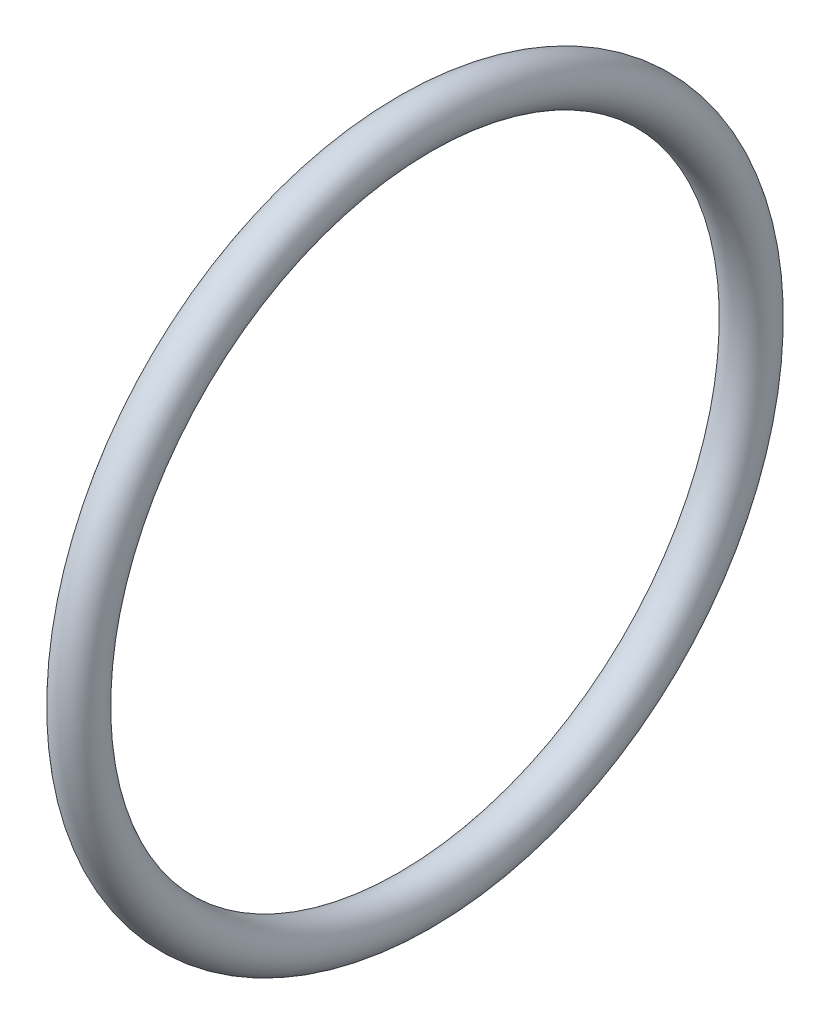
ISO-10303-21;
HEADER;
FILE_DESCRIPTION(('STEP AP214'),'2;1');
FILE_NAME('part.step','',(''),(''),'','','');
FILE_SCHEMA(('AUTOMOTIVE_DESIGN { 1 0 10303 214 1 1 1 1 }'));
ENDSEC;
DATA;
#1=APPLICATION_CONTEXT('core data for automotive mechanical design processes');
#2=APPLICATION_PROTOCOL_DEFINITION('international standard','automotive_design',2000,#1);
#3=PRODUCT_CONTEXT('',#1,'mechanical');
#4=PRODUCT('Part','Part','',(#3));
#5=PRODUCT_RELATED_PRODUCT_CATEGORY('part','',(#4));
#6=PRODUCT_DEFINITION_FORMATION('','',#4);
#7=PRODUCT_DEFINITION_CONTEXT('part definition',#1,'design');
#8=PRODUCT_DEFINITION('design','',#6,#7);
#9=PRODUCT_DEFINITION_SHAPE('','',#8);
#10=(LENGTH_UNIT() NAMED_UNIT(*) SI_UNIT(.MILLI.,.METRE.));
#11=(NAMED_UNIT(*) PLANE_ANGLE_UNIT() SI_UNIT($,.RADIAN.));
#12=(NAMED_UNIT(*) SI_UNIT($,.STERADIAN.) SOLID_ANGLE_UNIT());
#13=UNCERTAINTY_MEASURE_WITH_UNIT(LENGTH_MEASURE(1.E-05),#10,'distance_accuracy_value','');
#14=(GEOMETRIC_REPRESENTATION_CONTEXT(3) GLOBAL_UNCERTAINTY_ASSIGNED_CONTEXT((#13)) GLOBAL_UNIT_ASSIGNED_CONTEXT((#10,
#11,#12)) REPRESENTATION_CONTEXT('',''));
#15=CARTESIAN_POINT('',(0.,0.,0.));
#16=DIRECTION('',(0.,0.,1.));
#17=DIRECTION('',(1.,0.,0.));
#18=AXIS2_PLACEMENT_3D('',#15,#16,#17);
#19=CARTESIAN_POINT('',(0.,0.,0.));
#20=DIRECTION('',(1.,0.,0.));
#21=DIRECTION('',(0.,0.,-1.));
#22=AXIS2_PLACEMENT_3D('',#19,#20,#21);
#23=TOROIDAL_SURFACE('',#22,17.6784,1.190625);
#24=CARTESIAN_POINT('',(0.,-17.6784,0.));
#25=DIRECTION('',(0.,0.,1.));
#26=DIRECTION('',(1.,0.,0.));
#27=AXIS2_PLACEMENT_3D('',#24,#25,#26);
#28=CIRCLE('',#27,1.190625);
#29=CARTESIAN_POINT('',(0.,-18.869025,0.));
#30=VERTEX_POINT('',#29);
#31=EDGE_CURVE('E10',#30,#30,#28,.T.);
#32=CARTESIAN_POINT('',(0.,0.,0.));
#33=DIRECTION('',(1.,0.,0.));
#34=DIRECTION('',(0.,0.,-1.));
#35=AXIS2_PLACEMENT_3D('',#32,#33,#34);
#36=CIRCLE('',#35,18.869025);
#37=EDGE_CURVE('',#30,#30,#36,.T.);
#38=ORIENTED_EDGE('',*,*,#31,.F.);
#39=ORIENTED_EDGE('',*,*,#31,.T.);
#40=ORIENTED_EDGE('',*,*,#37,.T.);
#41=ORIENTED_EDGE('',*,*,#37,.F.);
#42=EDGE_LOOP('',(#38,#40,#39,#41));
#43=FACE_BOUND('',#42,.T.);
#44=ADVANCED_FACE('F43',(#43),#23,.T.);
#45=CLOSED_SHELL('',(#44));
#46=MANIFOLD_SOLID_BREP('B2',#45);
#47=ADVANCED_BREP_SHAPE_REPRESENTATION('',(#18,#46),#14);
#48=SHAPE_DEFINITION_REPRESENTATION(#9,#47);
ENDSEC;
END-ISO-10303-21;
